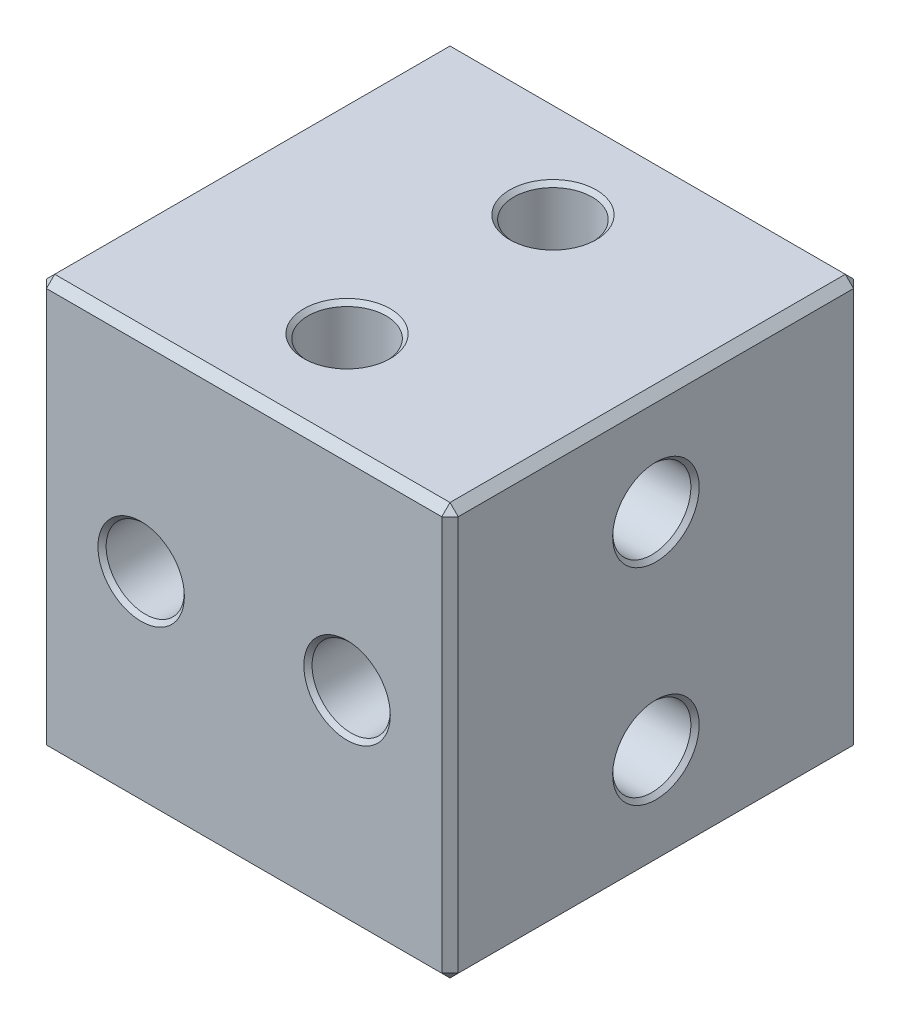
ISO-10303-21;
HEADER;
FILE_DESCRIPTION(('STEP AP214'),'2;1');
FILE_NAME('part.step','',(''),(''),'','','');
FILE_SCHEMA(('AUTOMOTIVE_DESIGN { 1 0 10303 214 1 1 1 1 }'));
ENDSEC;
DATA;
#1=APPLICATION_CONTEXT('core data for automotive mechanical design processes');
#2=APPLICATION_PROTOCOL_DEFINITION('international standard','automotive_design',2000,#1);
#3=PRODUCT_CONTEXT('',#1,'mechanical');
#4=PRODUCT('Part','Part','',(#3));
#5=PRODUCT_RELATED_PRODUCT_CATEGORY('part','',(#4));
#6=PRODUCT_DEFINITION_FORMATION('','',#4);
#7=PRODUCT_DEFINITION_CONTEXT('part definition',#1,'design');
#8=PRODUCT_DEFINITION('design','',#6,#7);
#9=PRODUCT_DEFINITION_SHAPE('','',#8);
#10=(LENGTH_UNIT() NAMED_UNIT(*) SI_UNIT(.MILLI.,.METRE.));
#11=(NAMED_UNIT(*) PLANE_ANGLE_UNIT() SI_UNIT($,.RADIAN.));
#12=(NAMED_UNIT(*) SI_UNIT($,.STERADIAN.) SOLID_ANGLE_UNIT());
#13=UNCERTAINTY_MEASURE_WITH_UNIT(LENGTH_MEASURE(1.E-05),#10,'distance_accuracy_value','');
#14=(GEOMETRIC_REPRESENTATION_CONTEXT(3) GLOBAL_UNCERTAINTY_ASSIGNED_CONTEXT((#13)) GLOBAL_UNIT_ASSIGNED_CONTEXT((#10,
#11,#12)) REPRESENTATION_CONTEXT('',''));
#15=CARTESIAN_POINT('',(0.,0.,0.));
#16=DIRECTION('',(0.,0.,1.));
#17=DIRECTION('',(1.,0.,0.));
#18=AXIS2_PLACEMENT_3D('',#15,#16,#17);
#19=CARTESIAN_POINT('',(-5.,5.,10.));
#20=DIRECTION('',(1.,0.,0.));
#21=DIRECTION('',(0.,1.,0.));
#22=AXIS2_PLACEMENT_3D('',#19,#20,#21);
#23=PLANE('',#22);
#24=CARTESIAN_POINT('',(-5.,-2.5,5.));
#25=DIRECTION('',(1.,0.,0.));
#26=DIRECTION('',(0.,1.,0.));
#27=AXIS2_PLACEMENT_3D('',#24,#25,#26);
#28=CIRCLE('',#27,1.05);
#29=CARTESIAN_POINT('',(-5.,-1.45,5.));
#30=VERTEX_POINT('',#29);
#31=EDGE_CURVE('E248',#30,#30,#28,.T.);
#32=ORIENTED_EDGE('',*,*,#31,.T.);
#33=EDGE_LOOP('',(#32));
#34=FACE_BOUND('',#33,.T.);
#35=CARTESIAN_POINT('',(-5.,2.5,5.));
#36=DIRECTION('',(1.,0.,0.));
#37=DIRECTION('',(0.,1.,0.));
#38=AXIS2_PLACEMENT_3D('',#35,#36,#37);
#39=CIRCLE('',#38,1.04999999999999);
#40=CARTESIAN_POINT('',(-5.,3.54999999999999,5.));
#41=VERTEX_POINT('',#40);
#42=EDGE_CURVE('E245',#41,#41,#39,.T.);
#43=ORIENTED_EDGE('',*,*,#42,.T.);
#44=EDGE_LOOP('',(#43));
#45=FACE_BOUND('',#44,.T.);
#46=DIRECTION('',(0.,-1.,0.));
#47=VECTOR('',#46,1.);
#48=CARTESIAN_POINT('',(-5.,5.,0.200000000000001));
#49=LINE('',#48,#47);
#50=CARTESIAN_POINT('',(-5.,4.8,0.200000000000001));
#51=VERTEX_POINT('',#50);
#52=CARTESIAN_POINT('',(-5.,-4.8,0.200000000000001));
#53=VERTEX_POINT('',#52);
#54=EDGE_CURVE('E503',#51,#53,#49,.T.);
#55=ORIENTED_EDGE('',*,*,#54,.T.);
#56=DIRECTION('',(0.,0.,1.));
#57=VECTOR('',#56,1.);
#58=CARTESIAN_POINT('',(-5.,-4.8,10.));
#59=LINE('',#58,#57);
#60=CARTESIAN_POINT('',(-5.,-4.8,9.8));
#61=VERTEX_POINT('',#60);
#62=EDGE_CURVE('E507',#53,#61,#59,.T.);
#63=ORIENTED_EDGE('',*,*,#62,.T.);
#64=DIRECTION('',(0.,1.,0.));
#65=VECTOR('',#64,1.);
#66=CARTESIAN_POINT('',(-5.,5.,9.8));
#67=LINE('',#66,#65);
#68=CARTESIAN_POINT('',(-5.,4.8,9.8));
#69=VERTEX_POINT('',#68);
#70=EDGE_CURVE('E505',#61,#69,#67,.T.);
#71=ORIENTED_EDGE('',*,*,#70,.T.);
#72=DIRECTION('',(0.,0.,-1.));
#73=VECTOR('',#72,1.);
#74=CARTESIAN_POINT('',(-5.,4.8,10.));
#75=LINE('',#74,#73);
#76=EDGE_CURVE('E484',#69,#51,#75,.T.);
#77=ORIENTED_EDGE('',*,*,#76,.T.);
#78=EDGE_LOOP('',(#55,#63,#71,#77));
#79=FACE_BOUND('',#78,.T.);
#80=ADVANCED_FACE('F35',(#34,#45,#79),#23,.F.);
#81=CARTESIAN_POINT('',(-5.,-5.,10.));
#82=DIRECTION('',(0.,1.,0.));
#83=DIRECTION('',(0.,0.,1.));
#84=AXIS2_PLACEMENT_3D('',#81,#82,#83);
#85=PLANE('',#84);
#86=CARTESIAN_POINT('',(0.,-5.,2.5));
#87=DIRECTION('',(0.,1.,0.));
#88=DIRECTION('',(0.,0.,1.));
#89=AXIS2_PLACEMENT_3D('',#86,#87,#88);
#90=CIRCLE('',#89,1.05);
#91=CARTESIAN_POINT('',(0.,-5.,3.55));
#92=VERTEX_POINT('',#91);
#93=EDGE_CURVE('E266',#92,#92,#90,.T.);
#94=ORIENTED_EDGE('',*,*,#93,.T.);
#95=EDGE_LOOP('',(#94));
#96=FACE_BOUND('',#95,.T.);
#97=CARTESIAN_POINT('',(0.,-5.,7.5));
#98=DIRECTION('',(0.,1.,0.));
#99=DIRECTION('',(0.,0.,1.));
#100=AXIS2_PLACEMENT_3D('',#97,#98,#99);
#101=CIRCLE('',#100,1.05);
#102=CARTESIAN_POINT('',(0.,-5.,8.55));
#103=VERTEX_POINT('',#102);
#104=EDGE_CURVE('E263',#103,#103,#101,.T.);
#105=ORIENTED_EDGE('',*,*,#104,.T.);
#106=EDGE_LOOP('',(#105));
#107=FACE_BOUND('',#106,.T.);
#108=DIRECTION('',(0.,0.,1.));
#109=VECTOR('',#108,1.);
#110=CARTESIAN_POINT('',(4.8,-5.,10.));
#111=LINE('',#110,#109);
#112=CARTESIAN_POINT('',(4.8,-5.,0.200000000000001));
#113=VERTEX_POINT('',#112);
#114=CARTESIAN_POINT('',(4.8,-5.,9.8));
#115=VERTEX_POINT('',#114);
#116=EDGE_CURVE('E464',#113,#115,#111,.T.);
#117=ORIENTED_EDGE('',*,*,#116,.T.);
#118=DIRECTION('',(-1.,0.,0.));
#119=VECTOR('',#118,1.);
#120=CARTESIAN_POINT('',(-5.,-5.,9.8));
#121=LINE('',#120,#119);
#122=CARTESIAN_POINT('',(-4.8,-5.,9.8));
#123=VERTEX_POINT('',#122);
#124=EDGE_CURVE('E467',#115,#123,#121,.T.);
#125=ORIENTED_EDGE('',*,*,#124,.T.);
#126=DIRECTION('',(0.,0.,-1.));
#127=VECTOR('',#126,1.);
#128=CARTESIAN_POINT('',(-4.8,-5.,10.));
#129=LINE('',#128,#127);
#130=CARTESIAN_POINT('',(-4.8,-5.,0.200000000000001));
#131=VERTEX_POINT('',#130);
#132=EDGE_CURVE('E471',#123,#131,#129,.T.);
#133=ORIENTED_EDGE('',*,*,#132,.T.);
#134=DIRECTION('',(1.,0.,0.));
#135=VECTOR('',#134,1.);
#136=CARTESIAN_POINT('',(-5.,-5.,0.200000000000001));
#137=LINE('',#136,#135);
#138=EDGE_CURVE('E469',#131,#113,#137,.T.);
#139=ORIENTED_EDGE('',*,*,#138,.T.);
#140=EDGE_LOOP('',(#117,#125,#133,#139));
#141=FACE_BOUND('',#140,.T.);
#142=ADVANCED_FACE('F296',(#96,#107,#141),#85,.F.);
#143=CARTESIAN_POINT('',(5.,5.,10.));
#144=DIRECTION('',(-1.,0.,0.));
#145=DIRECTION('',(0.,-1.,0.));
#146=AXIS2_PLACEMENT_3D('',#143,#144,#145);
#147=PLANE('',#146);
#148=CARTESIAN_POINT('',(5.,2.5,5.));
#149=DIRECTION('',(-1.,0.,0.));
#150=DIRECTION('',(0.,-1.,0.));
#151=AXIS2_PLACEMENT_3D('',#148,#149,#150);
#152=CIRCLE('',#151,1.05);
#153=CARTESIAN_POINT('',(5.,1.45,5.));
#154=VERTEX_POINT('',#153);
#155=EDGE_CURVE('E11',#154,#154,#152,.T.);
#156=ORIENTED_EDGE('',*,*,#155,.T.);
#157=EDGE_LOOP('',(#156));
#158=FACE_BOUND('',#157,.T.);
#159=CARTESIAN_POINT('',(5.,-2.5,5.));
#160=DIRECTION('',(-1.,0.,0.));
#161=DIRECTION('',(0.,-1.,0.));
#162=AXIS2_PLACEMENT_3D('',#159,#160,#161);
#163=CIRCLE('',#162,1.05);
#164=CARTESIAN_POINT('',(5.,-3.55,5.));
#165=VERTEX_POINT('',#164);
#166=EDGE_CURVE('E43',#165,#165,#163,.T.);
#167=ORIENTED_EDGE('',*,*,#166,.T.);
#168=EDGE_LOOP('',(#167));
#169=FACE_BOUND('',#168,.T.);
#170=DIRECTION('',(0.,0.,1.));
#171=VECTOR('',#170,1.);
#172=CARTESIAN_POINT('',(5.,4.8,10.));
#173=LINE('',#172,#171);
#174=CARTESIAN_POINT('',(5.,4.8,0.200000000000001));
#175=VERTEX_POINT('',#174);
#176=CARTESIAN_POINT('',(5.,4.8,9.8));
#177=VERTEX_POINT('',#176);
#178=EDGE_CURVE('E510',#175,#177,#173,.T.);
#179=ORIENTED_EDGE('',*,*,#178,.T.);
#180=DIRECTION('',(0.,-1.,0.));
#181=VECTOR('',#180,1.);
#182=CARTESIAN_POINT('',(5.,-5.,9.8));
#183=LINE('',#182,#181);
#184=CARTESIAN_POINT('',(5.,-4.8,9.8));
#185=VERTEX_POINT('',#184);
#186=EDGE_CURVE('E156',#177,#185,#183,.T.);
#187=ORIENTED_EDGE('',*,*,#186,.T.);
#188=DIRECTION('',(0.,0.,-1.));
#189=VECTOR('',#188,1.);
#190=CARTESIAN_POINT('',(5.,-4.8,10.));
#191=LINE('',#190,#189);
#192=CARTESIAN_POINT('',(5.,-4.8,0.200000000000001));
#193=VERTEX_POINT('',#192);
#194=EDGE_CURVE('E475',#185,#193,#191,.T.);
#195=ORIENTED_EDGE('',*,*,#194,.T.);
#196=DIRECTION('',(0.,1.,0.));
#197=VECTOR('',#196,1.);
#198=CARTESIAN_POINT('',(5.,5.,0.200000000000001));
#199=LINE('',#198,#197);
#200=EDGE_CURVE('E512',#193,#175,#199,.T.);
#201=ORIENTED_EDGE('',*,*,#200,.T.);
#202=EDGE_LOOP('',(#179,#187,#195,#201));
#203=FACE_BOUND('',#202,.T.);
#204=ADVANCED_FACE('F271',(#158,#169,#203),#147,.F.);
#205=CARTESIAN_POINT('',(-5.,5.,10.));
#206=DIRECTION('',(0.,-1.,0.));
#207=DIRECTION('',(0.,0.,-1.));
#208=AXIS2_PLACEMENT_3D('',#205,#206,#207);
#209=PLANE('',#208);
#210=CARTESIAN_POINT('',(0.,5.,2.5));
#211=DIRECTION('',(0.,-1.,0.));
#212=DIRECTION('',(0.,0.,-1.));
#213=AXIS2_PLACEMENT_3D('',#210,#211,#212);
#214=CIRCLE('',#213,1.05);
#215=CARTESIAN_POINT('',(0.,5.,1.45));
#216=VERTEX_POINT('',#215);
#217=EDGE_CURVE('E236',#216,#216,#214,.T.);
#218=ORIENTED_EDGE('',*,*,#217,.T.);
#219=EDGE_LOOP('',(#218));
#220=FACE_BOUND('',#219,.T.);
#221=CARTESIAN_POINT('',(0.,5.,7.5));
#222=DIRECTION('',(0.,-1.,0.));
#223=DIRECTION('',(0.,0.,-1.));
#224=AXIS2_PLACEMENT_3D('',#221,#222,#223);
#225=CIRCLE('',#224,1.05);
#226=CARTESIAN_POINT('',(0.,5.,6.45));
#227=VERTEX_POINT('',#226);
#228=EDGE_CURVE('E233',#227,#227,#225,.T.);
#229=ORIENTED_EDGE('',*,*,#228,.T.);
#230=EDGE_LOOP('',(#229));
#231=FACE_BOUND('',#230,.T.);
#232=DIRECTION('',(-1.,0.,0.));
#233=VECTOR('',#232,1.);
#234=CARTESIAN_POINT('',(-5.,5.,0.200000000000001));
#235=LINE('',#234,#233);
#236=CARTESIAN_POINT('',(4.8,5.,0.200000000000001));
#237=VERTEX_POINT('',#236);
#238=CARTESIAN_POINT('',(-4.8,5.,0.200000000000001));
#239=VERTEX_POINT('',#238);
#240=EDGE_CURVE('E525',#237,#239,#235,.T.);
#241=ORIENTED_EDGE('',*,*,#240,.T.);
#242=DIRECTION('',(0.,0.,1.));
#243=VECTOR('',#242,1.);
#244=CARTESIAN_POINT('',(-4.8,5.,10.));
#245=LINE('',#244,#243);
#246=CARTESIAN_POINT('',(-4.8,5.,9.8));
#247=VERTEX_POINT('',#246);
#248=EDGE_CURVE('E206',#239,#247,#245,.T.);
#249=ORIENTED_EDGE('',*,*,#248,.T.);
#250=DIRECTION('',(1.,0.,0.));
#251=VECTOR('',#250,1.);
#252=CARTESIAN_POINT('',(5.,5.,9.8));
#253=LINE('',#252,#251);
#254=CARTESIAN_POINT('',(4.8,5.,9.8));
#255=VERTEX_POINT('',#254);
#256=EDGE_CURVE('E58',#247,#255,#253,.T.);
#257=ORIENTED_EDGE('',*,*,#256,.T.);
#258=DIRECTION('',(0.,0.,-1.));
#259=VECTOR('',#258,1.);
#260=CARTESIAN_POINT('',(4.8,5.,10.));
#261=LINE('',#260,#259);
#262=EDGE_CURVE('E527',#255,#237,#261,.T.);
#263=ORIENTED_EDGE('',*,*,#262,.T.);
#264=EDGE_LOOP('',(#241,#249,#257,#263));
#265=FACE_BOUND('',#264,.T.);
#266=ADVANCED_FACE('F424',(#220,#231,#265),#209,.F.);
#267=CARTESIAN_POINT('',(-5.,-5.,10.));
#268=DIRECTION('',(0.,0.,1.));
#269=DIRECTION('',(1.,0.,0.));
#270=AXIS2_PLACEMENT_3D('',#267,#268,#269);
#271=PLANE('',#270);
#272=CARTESIAN_POINT('',(-2.5,0.,10.));
#273=DIRECTION('',(0.,0.,1.));
#274=DIRECTION('',(1.,0.,0.));
#275=AXIS2_PLACEMENT_3D('',#272,#273,#274);
#276=CIRCLE('',#275,1.05);
#277=CARTESIAN_POINT('',(-1.45,0.,10.));
#278=VERTEX_POINT('',#277);
#279=EDGE_CURVE('E224',#278,#278,#276,.F.);
#280=ORIENTED_EDGE('',*,*,#279,.T.);
#281=EDGE_LOOP('',(#280));
#282=FACE_BOUND('',#281,.T.);
#283=CARTESIAN_POINT('',(2.5,0.,10.));
#284=DIRECTION('',(0.,0.,1.));
#285=DIRECTION('',(1.,0.,0.));
#286=AXIS2_PLACEMENT_3D('',#283,#284,#285);
#287=CIRCLE('',#286,1.05);
#288=CARTESIAN_POINT('',(3.55,0.,10.));
#289=VERTEX_POINT('',#288);
#290=EDGE_CURVE('E221',#289,#289,#287,.F.);
#291=ORIENTED_EDGE('',*,*,#290,.T.);
#292=EDGE_LOOP('',(#291));
#293=FACE_BOUND('',#292,.T.);
#294=DIRECTION('',(0.,-1.,0.));
#295=VECTOR('',#294,1.);
#296=CARTESIAN_POINT('',(-4.8,-5.,10.));
#297=LINE('',#296,#295);
#298=CARTESIAN_POINT('',(-4.8,4.8,10.));
#299=VERTEX_POINT('',#298);
#300=CARTESIAN_POINT('',(-4.8,-4.8,10.));
#301=VERTEX_POINT('',#300);
#302=EDGE_CURVE('E136',#299,#301,#297,.T.);
#303=ORIENTED_EDGE('',*,*,#302,.T.);
#304=DIRECTION('',(1.,0.,0.));
#305=VECTOR('',#304,1.);
#306=CARTESIAN_POINT('',(5.,-4.8,10.));
#307=LINE('',#306,#305);
#308=CARTESIAN_POINT('',(4.8,-4.8,10.));
#309=VERTEX_POINT('',#308);
#310=EDGE_CURVE('E132',#301,#309,#307,.T.);
#311=ORIENTED_EDGE('',*,*,#310,.T.);
#312=DIRECTION('',(0.,1.,0.));
#313=VECTOR('',#312,1.);
#314=CARTESIAN_POINT('',(4.8,5.,10.));
#315=LINE('',#314,#313);
#316=CARTESIAN_POINT('',(4.8,4.8,10.));
#317=VERTEX_POINT('',#316);
#318=EDGE_CURVE('E127',#309,#317,#315,.T.);
#319=ORIENTED_EDGE('',*,*,#318,.T.);
#320=DIRECTION('',(-1.,0.,0.));
#321=VECTOR('',#320,1.);
#322=CARTESIAN_POINT('',(-5.,4.8,10.));
#323=LINE('',#322,#321);
#324=EDGE_CURVE('E130',#317,#299,#323,.T.);
#325=ORIENTED_EDGE('',*,*,#324,.T.);
#326=EDGE_LOOP('',(#303,#311,#319,#325));
#327=FACE_BOUND('',#326,.T.);
#328=ADVANCED_FACE('F129',(#282,#293,#327),#271,.T.);
#329=CARTESIAN_POINT('',(-5.,-5.,0.));
#330=DIRECTION('',(0.,0.,1.));
#331=DIRECTION('',(1.,0.,0.));
#332=AXIS2_PLACEMENT_3D('',#329,#330,#331);
#333=PLANE('',#332);
#334=CARTESIAN_POINT('',(-2.5,0.,0.));
#335=DIRECTION('',(0.,0.,1.));
#336=DIRECTION('',(1.,0.,0.));
#337=AXIS2_PLACEMENT_3D('',#334,#335,#336);
#338=CIRCLE('',#337,1.05);
#339=CARTESIAN_POINT('',(-1.45,0.,0.));
#340=VERTEX_POINT('',#339);
#341=EDGE_CURVE('E205',#340,#340,#338,.T.);
#342=ORIENTED_EDGE('',*,*,#341,.T.);
#343=EDGE_LOOP('',(#342));
#344=FACE_BOUND('',#343,.T.);
#345=CARTESIAN_POINT('',(2.5,0.,0.));
#346=DIRECTION('',(0.,0.,1.));
#347=DIRECTION('',(1.,0.,0.));
#348=AXIS2_PLACEMENT_3D('',#345,#346,#347);
#349=CIRCLE('',#348,1.05);
#350=CARTESIAN_POINT('',(3.55,0.,0.));
#351=VERTEX_POINT('',#350);
#352=EDGE_CURVE('E202',#351,#351,#349,.T.);
#353=ORIENTED_EDGE('',*,*,#352,.T.);
#354=EDGE_LOOP('',(#353));
#355=FACE_BOUND('',#354,.T.);
#356=DIRECTION('',(0.,-1.,0.));
#357=VECTOR('',#356,1.);
#358=CARTESIAN_POINT('',(4.8,-5.,0.));
#359=LINE('',#358,#357);
#360=CARTESIAN_POINT('',(4.8,4.8,0.));
#361=VERTEX_POINT('',#360);
#362=CARTESIAN_POINT('',(4.8,-4.8,0.));
#363=VERTEX_POINT('',#362);
#364=EDGE_CURVE('E520',#361,#363,#359,.T.);
#365=ORIENTED_EDGE('',*,*,#364,.T.);
#366=DIRECTION('',(-1.,0.,0.));
#367=VECTOR('',#366,1.);
#368=CARTESIAN_POINT('',(-5.,-4.8,0.));
#369=LINE('',#368,#367);
#370=CARTESIAN_POINT('',(-4.8,-4.8,0.));
#371=VERTEX_POINT('',#370);
#372=EDGE_CURVE('E522',#363,#371,#369,.T.);
#373=ORIENTED_EDGE('',*,*,#372,.T.);
#374=DIRECTION('',(0.,1.,0.));
#375=VECTOR('',#374,1.);
#376=CARTESIAN_POINT('',(-4.8,-5.,0.));
#377=LINE('',#376,#375);
#378=CARTESIAN_POINT('',(-4.8,4.8,0.));
#379=VERTEX_POINT('',#378);
#380=EDGE_CURVE('E518',#371,#379,#377,.T.);
#381=ORIENTED_EDGE('',*,*,#380,.T.);
#382=DIRECTION('',(1.,0.,0.));
#383=VECTOR('',#382,1.);
#384=CARTESIAN_POINT('',(-5.,4.8,0.));
#385=LINE('',#384,#383);
#386=EDGE_CURVE('E516',#379,#361,#385,.T.);
#387=ORIENTED_EDGE('',*,*,#386,.T.);
#388=EDGE_LOOP('',(#365,#373,#381,#387));
#389=FACE_BOUND('',#388,.T.);
#390=ADVANCED_FACE('F431',(#344,#355,#389),#333,.F.);
#391=CARTESIAN_POINT('',(-2.5,0.,0.));
#392=DIRECTION('',(0.,0.,1.));
#393=DIRECTION('',(1.,0.,0.));
#394=AXIS2_PLACEMENT_3D('',#391,#392,#393);
#395=CYLINDRICAL_SURFACE('',#394,0.95);
#396=CARTESIAN_POINT('',(-2.5,0.,0.100000000000001));
#397=DIRECTION('',(0.,0.,1.));
#398=DIRECTION('',(1.,0.,0.));
#399=AXIS2_PLACEMENT_3D('',#396,#397,#398);
#400=CIRCLE('',#399,0.95);
#401=CARTESIAN_POINT('',(-1.55,0.,0.100000000000001));
#402=VERTEX_POINT('',#401);
#403=EDGE_CURVE('E212',#402,#402,#400,.F.);
#404=ORIENTED_EDGE('',*,*,#403,.T.);
#405=EDGE_LOOP('',(#404));
#406=FACE_BOUND('',#405,.T.);
#407=CARTESIAN_POINT('',(-2.5,0.,9.9));
#408=DIRECTION('',(0.,0.,1.));
#409=DIRECTION('',(1.,0.,0.));
#410=AXIS2_PLACEMENT_3D('',#407,#408,#409);
#411=CIRCLE('',#410,0.95);
#412=CARTESIAN_POINT('',(-1.55,0.,9.9));
#413=VERTEX_POINT('',#412);
#414=EDGE_CURVE('E209',#413,#413,#411,.T.);
#415=ORIENTED_EDGE('',*,*,#414,.T.);
#416=EDGE_LOOP('',(#415));
#417=FACE_BOUND('',#416,.T.);
#418=ADVANCED_FACE('F434',(#406,#417),#395,.F.);
#419=CARTESIAN_POINT('',(2.5,0.,0.));
#420=DIRECTION('',(0.,0.,1.));
#421=DIRECTION('',(1.,0.,0.));
#422=AXIS2_PLACEMENT_3D('',#419,#420,#421);
#423=CYLINDRICAL_SURFACE('',#422,0.95);
#424=CARTESIAN_POINT('',(2.5,0.,0.100000000000001));
#425=DIRECTION('',(0.,0.,1.));
#426=DIRECTION('',(1.,0.,0.));
#427=AXIS2_PLACEMENT_3D('',#424,#425,#426);
#428=CIRCLE('',#427,0.95);
#429=CARTESIAN_POINT('',(3.45,0.,0.100000000000001));
#430=VERTEX_POINT('',#429);
#431=EDGE_CURVE('E218',#430,#430,#428,.F.);
#432=ORIENTED_EDGE('',*,*,#431,.T.);
#433=EDGE_LOOP('',(#432));
#434=FACE_BOUND('',#433,.T.);
#435=CARTESIAN_POINT('',(2.5,0.,9.9));
#436=DIRECTION('',(0.,0.,1.));
#437=DIRECTION('',(1.,0.,0.));
#438=AXIS2_PLACEMENT_3D('',#435,#436,#437);
#439=CIRCLE('',#438,0.95);
#440=CARTESIAN_POINT('',(3.45,0.,9.9));
#441=VERTEX_POINT('',#440);
#442=EDGE_CURVE('E215',#441,#441,#439,.T.);
#443=ORIENTED_EDGE('',*,*,#442,.T.);
#444=EDGE_LOOP('',(#443));
#445=FACE_BOUND('',#444,.T.);
#446=ADVANCED_FACE('F441',(#434,#445),#423,.F.);
#447=CARTESIAN_POINT('',(0.,-5.,7.5));
#448=DIRECTION('',(0.,1.,0.));
#449=DIRECTION('',(0.,0.,1.));
#450=AXIS2_PLACEMENT_3D('',#447,#448,#449);
#451=CYLINDRICAL_SURFACE('',#450,0.95);
#452=CARTESIAN_POINT('',(0.,4.9,7.5));
#453=DIRECTION('',(0.,-1.,0.));
#454=DIRECTION('',(0.,0.,-1.));
#455=AXIS2_PLACEMENT_3D('',#452,#453,#454);
#456=CIRCLE('',#455,0.95);
#457=CARTESIAN_POINT('',(0.,4.9,6.55));
#458=VERTEX_POINT('',#457);
#459=EDGE_CURVE('E242',#458,#458,#456,.F.);
#460=ORIENTED_EDGE('',*,*,#459,.T.);
#461=EDGE_LOOP('',(#460));
#462=FACE_BOUND('',#461,.T.);
#463=CARTESIAN_POINT('',(0.,-4.9,7.5));
#464=DIRECTION('',(0.,1.,0.));
#465=DIRECTION('',(0.,0.,1.));
#466=AXIS2_PLACEMENT_3D('',#463,#464,#465);
#467=CIRCLE('',#466,0.95);
#468=CARTESIAN_POINT('',(0.,-4.9,8.45));
#469=VERTEX_POINT('',#468);
#470=EDGE_CURVE('E239',#469,#469,#467,.F.);
#471=ORIENTED_EDGE('',*,*,#470,.T.);
#472=EDGE_LOOP('',(#471));
#473=FACE_BOUND('',#472,.T.);
#474=ADVANCED_FACE('F445',(#462,#473),#451,.F.);
#475=CARTESIAN_POINT('',(0.,-5.,2.5));
#476=DIRECTION('',(0.,1.,0.));
#477=DIRECTION('',(0.,0.,1.));
#478=AXIS2_PLACEMENT_3D('',#475,#476,#477);
#479=CYLINDRICAL_SURFACE('',#478,0.95);
#480=CARTESIAN_POINT('',(0.,4.9,2.5));
#481=DIRECTION('',(0.,-1.,0.));
#482=DIRECTION('',(0.,0.,-1.));
#483=AXIS2_PLACEMENT_3D('',#480,#481,#482);
#484=CIRCLE('',#483,0.95);
#485=CARTESIAN_POINT('',(0.,4.9,1.55));
#486=VERTEX_POINT('',#485);
#487=EDGE_CURVE('E230',#486,#486,#484,.F.);
#488=ORIENTED_EDGE('',*,*,#487,.T.);
#489=EDGE_LOOP('',(#488));
#490=FACE_BOUND('',#489,.T.);
#491=CARTESIAN_POINT('',(0.,-4.9,2.5));
#492=DIRECTION('',(0.,1.,0.));
#493=DIRECTION('',(0.,0.,1.));
#494=AXIS2_PLACEMENT_3D('',#491,#492,#493);
#495=CIRCLE('',#494,0.95);
#496=CARTESIAN_POINT('',(0.,-4.9,3.45));
#497=VERTEX_POINT('',#496);
#498=EDGE_CURVE('E227',#497,#497,#495,.F.);
#499=ORIENTED_EDGE('',*,*,#498,.T.);
#500=EDGE_LOOP('',(#499));
#501=FACE_BOUND('',#500,.T.);
#502=ADVANCED_FACE('F292',(#490,#501),#479,.F.);
#503=CARTESIAN_POINT('',(-5.,2.5,5.));
#504=DIRECTION('',(1.,0.,0.));
#505=DIRECTION('',(0.,1.,0.));
#506=AXIS2_PLACEMENT_3D('',#503,#504,#505);
#507=CYLINDRICAL_SURFACE('',#506,0.95);
#508=CARTESIAN_POINT('',(-4.90000000000001,2.5,5.));
#509=DIRECTION('',(1.,0.,0.));
#510=DIRECTION('',(0.,0.,-1.));
#511=AXIS2_PLACEMENT_3D('',#508,#509,#510);
#512=CIRCLE('',#511,0.95);
#513=CARTESIAN_POINT('',(-4.90000000000001,2.5,4.05));
#514=VERTEX_POINT('',#513);
#515=EDGE_CURVE('E260',#514,#514,#512,.F.);
#516=ORIENTED_EDGE('',*,*,#515,.T.);
#517=EDGE_LOOP('',(#516));
#518=FACE_BOUND('',#517,.T.);
#519=CARTESIAN_POINT('',(4.9,2.5,5.));
#520=DIRECTION('',(-1.,0.,0.));
#521=DIRECTION('',(0.,0.,1.));
#522=AXIS2_PLACEMENT_3D('',#519,#520,#521);
#523=CIRCLE('',#522,0.95);
#524=CARTESIAN_POINT('',(4.9,2.5,5.95));
#525=VERTEX_POINT('',#524);
#526=EDGE_CURVE('E257',#525,#525,#523,.F.);
#527=ORIENTED_EDGE('',*,*,#526,.T.);
#528=EDGE_LOOP('',(#527));
#529=FACE_BOUND('',#528,.T.);
#530=ADVANCED_FACE('F282',(#518,#529),#507,.F.);
#531=CARTESIAN_POINT('',(-5.,-2.5,5.));
#532=DIRECTION('',(1.,0.,0.));
#533=DIRECTION('',(0.,1.,0.));
#534=AXIS2_PLACEMENT_3D('',#531,#532,#533);
#535=CYLINDRICAL_SURFACE('',#534,0.95);
#536=CARTESIAN_POINT('',(-4.9,-2.5,5.));
#537=DIRECTION('',(1.,0.,0.));
#538=DIRECTION('',(0.,0.,-1.));
#539=AXIS2_PLACEMENT_3D('',#536,#537,#538);
#540=CIRCLE('',#539,0.95);
#541=CARTESIAN_POINT('',(-4.9,-2.5,4.05));
#542=VERTEX_POINT('',#541);
#543=EDGE_CURVE('E254',#542,#542,#540,.F.);
#544=ORIENTED_EDGE('',*,*,#543,.T.);
#545=EDGE_LOOP('',(#544));
#546=FACE_BOUND('',#545,.T.);
#547=CARTESIAN_POINT('',(4.9,-2.5,5.));
#548=DIRECTION('',(-1.,0.,0.));
#549=DIRECTION('',(0.,0.,1.));
#550=AXIS2_PLACEMENT_3D('',#547,#548,#549);
#551=CIRCLE('',#550,0.95);
#552=CARTESIAN_POINT('',(4.9,-2.5,5.95));
#553=VERTEX_POINT('',#552);
#554=EDGE_CURVE('E251',#553,#553,#551,.F.);
#555=ORIENTED_EDGE('',*,*,#554,.T.);
#556=EDGE_LOOP('',(#555));
#557=FACE_BOUND('',#556,.T.);
#558=ADVANCED_FACE('F279',(#546,#557),#535,.F.);
#559=CARTESIAN_POINT('',(-5.,5.,0.200000000000001));
#560=DIRECTION('',(0.,-0.707106781186551,0.707106781186544));
#561=DIRECTION('',(0.,-0.707106781186544,-0.707106781186551));
#562=AXIS2_PLACEMENT_3D('',#559,#560,#561);
#563=PLANE('',#562);
#564=DIRECTION('',(0.,0.707106781186544,0.70710678118655));
#565=VECTOR('',#564,1.);
#566=CARTESIAN_POINT('',(-4.8,4.8,0.));
#567=LINE('',#566,#565);
#568=EDGE_CURVE('E144',#239,#379,#567,.F.);
#569=ORIENTED_EDGE('',*,*,#568,.F.);
#570=ORIENTED_EDGE('',*,*,#240,.F.);
#571=DIRECTION('',(0.,-0.707106781186544,-0.70710678118655));
#572=VECTOR('',#571,1.);
#573=CARTESIAN_POINT('',(4.8,4.9,0.100000000000001));
#574=LINE('',#573,#572);
#575=EDGE_CURVE('E197',#361,#237,#574,.F.);
#576=ORIENTED_EDGE('',*,*,#575,.F.);
#577=ORIENTED_EDGE('',*,*,#386,.F.);
#578=EDGE_LOOP('',(#569,#570,#576,#577));
#579=FACE_BOUND('',#578,.T.);
#580=ADVANCED_FACE('F281',(#579),#563,.F.);
#581=CARTESIAN_POINT('',(-4.8,4.8,0.));
#582=DIRECTION('',(-0.577350269189625,0.57735026918963,-0.577350269189622));
#583=DIRECTION('',(-0.707106781186551,-0.707106781186545,0.));
#584=AXIS2_PLACEMENT_3D('',#581,#582,#583);
#585=PLANE('',#584);
#586=DIRECTION('',(-0.707106781186551,-0.707106781186544,0.));
#587=VECTOR('',#586,1.);
#588=CARTESIAN_POINT('',(-4.9,4.9,0.200000000000001));
#589=LINE('',#588,#587);
#590=EDGE_CURVE('E191',#239,#51,#589,.T.);
#591=ORIENTED_EDGE('',*,*,#590,.F.);
#592=ORIENTED_EDGE('',*,*,#568,.T.);
#593=DIRECTION('',(0.707106781186546,0.,-0.707106781186549));
#594=VECTOR('',#593,1.);
#595=CARTESIAN_POINT('',(-4.8,4.8,0.));
#596=LINE('',#595,#594);
#597=EDGE_CURVE('E194',#51,#379,#596,.T.);
#598=ORIENTED_EDGE('',*,*,#597,.F.);
#599=EDGE_LOOP('',(#591,#592,#598));
#600=FACE_BOUND('',#599,.T.);
#601=ADVANCED_FACE('F289',(#600),#585,.T.);
#602=CARTESIAN_POINT('',(5.,4.8,0.200000000000001));
#603=DIRECTION('',(0.577350269189625,0.57735026918963,-0.577350269189622));
#604=DIRECTION('',(-0.707106781186551,0.707106781186545,0.));
#605=AXIS2_PLACEMENT_3D('',#602,#603,#604);
#606=PLANE('',#605);
#607=DIRECTION('',(0.707106781186546,0.,0.707106781186549));
#608=VECTOR('',#607,1.);
#609=CARTESIAN_POINT('',(5.,4.8,0.200000000000001));
#610=LINE('',#609,#608);
#611=EDGE_CURVE('E185',#361,#175,#610,.T.);
#612=ORIENTED_EDGE('',*,*,#611,.F.);
#613=ORIENTED_EDGE('',*,*,#575,.T.);
#614=DIRECTION('',(-0.707106781186551,0.707106781186544,0.));
#615=VECTOR('',#614,1.);
#616=CARTESIAN_POINT('',(5.,4.8,0.200000000000001));
#617=LINE('',#616,#615);
#618=EDGE_CURVE('E188',#175,#237,#617,.T.);
#619=ORIENTED_EDGE('',*,*,#618,.F.);
#620=EDGE_LOOP('',(#612,#613,#619));
#621=FACE_BOUND('',#620,.T.);
#622=ADVANCED_FACE('F368',(#621),#606,.T.);
#623=CARTESIAN_POINT('',(-5.,5.,0.200000000000001));
#624=DIRECTION('',(0.707106781186549,0.,0.707106781186546));
#625=DIRECTION('',(0.707106781186546,0.,-0.707106781186549));
#626=AXIS2_PLACEMENT_3D('',#623,#624,#625);
#627=PLANE('',#626);
#628=ORIENTED_EDGE('',*,*,#597,.T.);
#629=ORIENTED_EDGE('',*,*,#380,.F.);
#630=DIRECTION('',(-0.707106781186546,0.,0.707106781186549));
#631=VECTOR('',#630,1.);
#632=CARTESIAN_POINT('',(-4.9,-4.8,0.1));
#633=LINE('',#632,#631);
#634=EDGE_CURVE('E180',#53,#371,#633,.F.);
#635=ORIENTED_EDGE('',*,*,#634,.F.);
#636=ORIENTED_EDGE('',*,*,#54,.F.);
#637=EDGE_LOOP('',(#628,#629,#635,#636));
#638=FACE_BOUND('',#637,.T.);
#639=ADVANCED_FACE('F364',(#638),#627,.F.);
#640=CARTESIAN_POINT('',(-5.,4.8,10.));
#641=DIRECTION('',(0.707106781186544,-0.707106781186551,0.));
#642=DIRECTION('',(0.707106781186551,0.707106781186544,0.));
#643=AXIS2_PLACEMENT_3D('',#640,#641,#642);
#644=PLANE('',#643);
#645=ORIENTED_EDGE('',*,*,#590,.T.);
#646=ORIENTED_EDGE('',*,*,#76,.F.);
#647=DIRECTION('',(0.707106781186551,0.707106781186545,0.));
#648=VECTOR('',#647,1.);
#649=CARTESIAN_POINT('',(-5.,4.8,9.8));
#650=LINE('',#649,#648);
#651=EDGE_CURVE('E178',#247,#69,#650,.F.);
#652=ORIENTED_EDGE('',*,*,#651,.F.);
#653=ORIENTED_EDGE('',*,*,#248,.F.);
#654=EDGE_LOOP('',(#645,#646,#652,#653));
#655=FACE_BOUND('',#654,.T.);
#656=ADVANCED_FACE('F361',(#655),#644,.F.);
#657=CARTESIAN_POINT('',(-5.,4.8,10.));
#658=DIRECTION('',(0.,0.707106781186551,0.707106781186544));
#659=DIRECTION('',(0.,-0.707106781186544,0.707106781186551));
#660=AXIS2_PLACEMENT_3D('',#657,#658,#659);
#661=PLANE('',#660);
#662=DIRECTION('',(0.,-0.707106781186544,0.707106781186551));
#663=VECTOR('',#662,1.);
#664=CARTESIAN_POINT('',(4.8,4.8,10.));
#665=LINE('',#664,#663);
#666=EDGE_CURVE('E142',#255,#317,#665,.T.);
#667=ORIENTED_EDGE('',*,*,#666,.F.);
#668=ORIENTED_EDGE('',*,*,#256,.F.);
#669=DIRECTION('',(0.,0.707106781186544,-0.707106781186551));
#670=VECTOR('',#669,1.);
#671=CARTESIAN_POINT('',(-4.8,4.9,9.9));
#672=LINE('',#671,#670);
#673=EDGE_CURVE('E50',#299,#247,#672,.T.);
#674=ORIENTED_EDGE('',*,*,#673,.F.);
#675=ORIENTED_EDGE('',*,*,#324,.F.);
#676=EDGE_LOOP('',(#667,#668,#674,#675));
#677=FACE_BOUND('',#676,.T.);
#678=ADVANCED_FACE('F141',(#677),#661,.T.);
#679=CARTESIAN_POINT('',(4.8,5.,10.));
#680=DIRECTION('',(-0.707106781186544,-0.707106781186551,0.));
#681=DIRECTION('',(0.707106781186551,-0.707106781186544,0.));
#682=AXIS2_PLACEMENT_3D('',#679,#680,#681);
#683=PLANE('',#682);
#684=ORIENTED_EDGE('',*,*,#618,.T.);
#685=ORIENTED_EDGE('',*,*,#262,.F.);
#686=DIRECTION('',(0.707106781186551,-0.707106781186544,0.));
#687=VECTOR('',#686,1.);
#688=CARTESIAN_POINT('',(4.9,4.9,9.8));
#689=LINE('',#688,#687);
#690=EDGE_CURVE('E152',#177,#255,#689,.F.);
#691=ORIENTED_EDGE('',*,*,#690,.F.);
#692=ORIENTED_EDGE('',*,*,#178,.F.);
#693=EDGE_LOOP('',(#684,#685,#691,#692));
#694=FACE_BOUND('',#693,.T.);
#695=ADVANCED_FACE('F354',(#694),#683,.F.);
#696=CARTESIAN_POINT('',(5.,5.,0.200000000000001));
#697=DIRECTION('',(-0.707106781186549,0.,0.707106781186546));
#698=DIRECTION('',(0.707106781186546,0.,0.707106781186549));
#699=AXIS2_PLACEMENT_3D('',#696,#697,#698);
#700=PLANE('',#699);
#701=ORIENTED_EDGE('',*,*,#611,.T.);
#702=ORIENTED_EDGE('',*,*,#200,.F.);
#703=DIRECTION('',(-0.707106781186546,0.,-0.707106781186549));
#704=VECTOR('',#703,1.);
#705=CARTESIAN_POINT('',(5.,-4.8,0.200000000000001));
#706=LINE('',#705,#704);
#707=EDGE_CURVE('E173',#363,#193,#706,.F.);
#708=ORIENTED_EDGE('',*,*,#707,.F.);
#709=ORIENTED_EDGE('',*,*,#364,.F.);
#710=EDGE_LOOP('',(#701,#702,#708,#709));
#711=FACE_BOUND('',#710,.T.);
#712=ADVANCED_FACE('F350',(#711),#700,.F.);
#713=CARTESIAN_POINT('',(-5.,-5.,0.200000000000001));
#714=DIRECTION('',(0.,0.707106781186551,0.707106781186544));
#715=DIRECTION('',(0.,-0.707106781186544,0.707106781186551));
#716=AXIS2_PLACEMENT_3D('',#713,#714,#715);
#717=PLANE('',#716);
#718=DIRECTION('',(0.,0.707106781186544,-0.70710678118655));
#719=VECTOR('',#718,1.);
#720=CARTESIAN_POINT('',(-4.8,-5.,0.200000000000001));
#721=LINE('',#720,#719);
#722=EDGE_CURVE('E182',#371,#131,#721,.F.);
#723=ORIENTED_EDGE('',*,*,#722,.F.);
#724=ORIENTED_EDGE('',*,*,#372,.F.);
#725=DIRECTION('',(0.,-0.707106781186544,0.707106781186551));
#726=VECTOR('',#725,1.);
#727=CARTESIAN_POINT('',(4.8,-4.9,0.1));
#728=LINE('',#727,#726);
#729=EDGE_CURVE('E170',#113,#363,#728,.F.);
#730=ORIENTED_EDGE('',*,*,#729,.F.);
#731=ORIENTED_EDGE('',*,*,#138,.F.);
#732=EDGE_LOOP('',(#723,#724,#730,#731));
#733=FACE_BOUND('',#732,.T.);
#734=ADVANCED_FACE('F346',(#733),#717,.F.);
#735=CARTESIAN_POINT('',(-4.8,-5.,0.200000000000001));
#736=DIRECTION('',(-0.577350269189625,-0.57735026918963,-0.577350269189622));
#737=DIRECTION('',(0.707106781186551,-0.707106781186545,0.));
#738=AXIS2_PLACEMENT_3D('',#735,#736,#737);
#739=PLANE('',#738);
#740=ORIENTED_EDGE('',*,*,#634,.T.);
#741=ORIENTED_EDGE('',*,*,#722,.T.);
#742=DIRECTION('',(0.707106781186551,-0.707106781186544,0.));
#743=VECTOR('',#742,1.);
#744=CARTESIAN_POINT('',(-4.8,-5.,0.200000000000001));
#745=LINE('',#744,#743);
#746=EDGE_CURVE('E161',#53,#131,#745,.T.);
#747=ORIENTED_EDGE('',*,*,#746,.F.);
#748=EDGE_LOOP('',(#740,#741,#747));
#749=FACE_BOUND('',#748,.T.);
#750=ADVANCED_FACE('F343',(#749),#739,.T.);
#751=CARTESIAN_POINT('',(-5.,4.8,9.8));
#752=DIRECTION('',(-0.57735026918962,0.57735026918963,0.577350269189627));
#753=DIRECTION('',(0.,-0.707106781186546,0.707106781186549));
#754=AXIS2_PLACEMENT_3D('',#751,#752,#753);
#755=PLANE('',#754);
#756=ORIENTED_EDGE('',*,*,#673,.T.);
#757=ORIENTED_EDGE('',*,*,#651,.T.);
#758=DIRECTION('',(0.707106781186552,0.,0.707106781186543));
#759=VECTOR('',#758,1.);
#760=CARTESIAN_POINT('',(-5.,4.8,9.8));
#761=LINE('',#760,#759);
#762=EDGE_CURVE('E157',#299,#69,#761,.F.);
#763=ORIENTED_EDGE('',*,*,#762,.F.);
#764=EDGE_LOOP('',(#756,#757,#763));
#765=FACE_BOUND('',#764,.T.);
#766=ADVANCED_FACE('F340',(#765),#755,.T.);
#767=CARTESIAN_POINT('',(4.8,4.8,10.));
#768=DIRECTION('',(0.577350269189622,0.577350269189632,0.577350269189624));
#769=DIRECTION('',(0.,-0.707106781186543,0.707106781186552));
#770=AXIS2_PLACEMENT_3D('',#767,#768,#769);
#771=PLANE('',#770);
#772=ORIENTED_EDGE('',*,*,#690,.T.);
#773=ORIENTED_EDGE('',*,*,#666,.T.);
#774=DIRECTION('',(0.707106781186549,0.,-0.707106781186546));
#775=VECTOR('',#774,1.);
#776=CARTESIAN_POINT('',(4.8,4.8,10.));
#777=LINE('',#776,#775);
#778=EDGE_CURVE('E149',#177,#317,#777,.F.);
#779=ORIENTED_EDGE('',*,*,#778,.F.);
#780=EDGE_LOOP('',(#772,#773,#779));
#781=FACE_BOUND('',#780,.T.);
#782=ADVANCED_FACE('F148',(#781),#771,.T.);
#783=CARTESIAN_POINT('',(5.,-4.8,0.200000000000001));
#784=DIRECTION('',(0.577350269189629,-0.577350269189627,-0.577350269189622));
#785=DIRECTION('',(0.707106781186546,0.707106781186549,0.));
#786=AXIS2_PLACEMENT_3D('',#783,#784,#785);
#787=PLANE('',#786);
#788=ORIENTED_EDGE('',*,*,#729,.T.);
#789=ORIENTED_EDGE('',*,*,#707,.T.);
#790=DIRECTION('',(0.707106781186546,0.707106781186549,0.));
#791=VECTOR('',#790,1.);
#792=CARTESIAN_POINT('',(5.,-4.8,0.200000000000001));
#793=LINE('',#792,#791);
#794=EDGE_CURVE('E158',#113,#193,#793,.T.);
#795=ORIENTED_EDGE('',*,*,#794,.F.);
#796=EDGE_LOOP('',(#788,#789,#795));
#797=FACE_BOUND('',#796,.T.);
#798=ADVANCED_FACE('F333',(#797),#787,.T.);
#799=CARTESIAN_POINT('',(-4.8,-5.,10.));
#800=DIRECTION('',(0.707106781186544,0.707106781186551,0.));
#801=DIRECTION('',(-0.707106781186551,0.707106781186544,0.));
#802=AXIS2_PLACEMENT_3D('',#799,#800,#801);
#803=PLANE('',#802);
#804=ORIENTED_EDGE('',*,*,#746,.T.);
#805=ORIENTED_EDGE('',*,*,#132,.F.);
#806=DIRECTION('',(-0.707106781186551,0.707106781186544,0.));
#807=VECTOR('',#806,1.);
#808=CARTESIAN_POINT('',(-4.8,-5.,9.8));
#809=LINE('',#808,#807);
#810=EDGE_CURVE('E164',#61,#123,#809,.F.);
#811=ORIENTED_EDGE('',*,*,#810,.F.);
#812=ORIENTED_EDGE('',*,*,#62,.F.);
#813=EDGE_LOOP('',(#804,#805,#811,#812));
#814=FACE_BOUND('',#813,.T.);
#815=ADVANCED_FACE('F329',(#814),#803,.F.);
#816=CARTESIAN_POINT('',(-4.8,-5.,10.));
#817=DIRECTION('',(-0.707106781186543,0.,0.707106781186552));
#818=DIRECTION('',(0.707106781186552,0.,0.707106781186543));
#819=AXIS2_PLACEMENT_3D('',#816,#817,#818);
#820=PLANE('',#819);
#821=ORIENTED_EDGE('',*,*,#762,.T.);
#822=ORIENTED_EDGE('',*,*,#70,.F.);
#823=DIRECTION('',(-0.707106781186552,0.,-0.707106781186543));
#824=VECTOR('',#823,1.);
#825=CARTESIAN_POINT('',(-4.9,-4.8,9.9));
#826=LINE('',#825,#824);
#827=EDGE_CURVE('E492',#301,#61,#826,.T.);
#828=ORIENTED_EDGE('',*,*,#827,.F.);
#829=ORIENTED_EDGE('',*,*,#302,.F.);
#830=EDGE_LOOP('',(#821,#822,#828,#829));
#831=FACE_BOUND('',#830,.T.);
#832=ADVANCED_FACE('F326',(#831),#820,.T.);
#833=CARTESIAN_POINT('',(4.8,-5.,10.));
#834=DIRECTION('',(0.707106781186546,0.,0.707106781186549));
#835=DIRECTION('',(0.707106781186549,0.,-0.707106781186546));
#836=AXIS2_PLACEMENT_3D('',#833,#834,#835);
#837=PLANE('',#836);
#838=ORIENTED_EDGE('',*,*,#778,.T.);
#839=ORIENTED_EDGE('',*,*,#318,.F.);
#840=DIRECTION('',(-0.707106781186549,0.,0.707106781186546));
#841=VECTOR('',#840,1.);
#842=CARTESIAN_POINT('',(4.8,-4.8,10.));
#843=LINE('',#842,#841);
#844=EDGE_CURVE('E478',#185,#309,#843,.T.);
#845=ORIENTED_EDGE('',*,*,#844,.F.);
#846=ORIENTED_EDGE('',*,*,#186,.F.);
#847=EDGE_LOOP('',(#838,#839,#845,#846));
#848=FACE_BOUND('',#847,.T.);
#849=ADVANCED_FACE('F154',(#848),#837,.T.);
#850=CARTESIAN_POINT('',(5.,-4.8,10.));
#851=DIRECTION('',(-0.707106781186549,0.707106781186546,0.));
#852=DIRECTION('',(-0.707106781186546,-0.707106781186549,0.));
#853=AXIS2_PLACEMENT_3D('',#850,#851,#852);
#854=PLANE('',#853);
#855=ORIENTED_EDGE('',*,*,#794,.T.);
#856=ORIENTED_EDGE('',*,*,#194,.F.);
#857=DIRECTION('',(-0.707106781186546,-0.707106781186549,0.));
#858=VECTOR('',#857,1.);
#859=CARTESIAN_POINT('',(4.9,-4.9,9.8));
#860=LINE('',#859,#858);
#861=EDGE_CURVE('E474',#115,#185,#860,.F.);
#862=ORIENTED_EDGE('',*,*,#861,.F.);
#863=ORIENTED_EDGE('',*,*,#116,.F.);
#864=EDGE_LOOP('',(#855,#856,#862,#863));
#865=FACE_BOUND('',#864,.T.);
#866=ADVANCED_FACE('F319',(#865),#854,.F.);
#867=CARTESIAN_POINT('',(-4.8,-5.,9.8));
#868=DIRECTION('',(-0.57735026918962,-0.577350269189625,0.577350269189633));
#869=DIRECTION('',(0.,-0.707106781186552,-0.707106781186543));
#870=AXIS2_PLACEMENT_3D('',#867,#868,#869);
#871=PLANE('',#870);
#872=ORIENTED_EDGE('',*,*,#827,.T.);
#873=ORIENTED_EDGE('',*,*,#810,.T.);
#874=DIRECTION('',(0.,0.707106781186551,0.707106781186544));
#875=VECTOR('',#874,1.);
#876=CARTESIAN_POINT('',(-4.8,-5.,9.8));
#877=LINE('',#876,#875);
#878=EDGE_CURVE('E479',#301,#123,#877,.F.);
#879=ORIENTED_EDGE('',*,*,#878,.F.);
#880=EDGE_LOOP('',(#872,#873,#879));
#881=FACE_BOUND('',#880,.T.);
#882=ADVANCED_FACE('F315',(#881),#871,.T.);
#883=CARTESIAN_POINT('',(4.8,-4.8,10.));
#884=DIRECTION('',(0.577350269189626,-0.577350269189623,0.577350269189628));
#885=DIRECTION('',(0.707106781186549,0.,-0.707106781186546));
#886=AXIS2_PLACEMENT_3D('',#883,#884,#885);
#887=PLANE('',#886);
#888=ORIENTED_EDGE('',*,*,#861,.T.);
#889=ORIENTED_EDGE('',*,*,#844,.T.);
#890=DIRECTION('',(0.,-0.707106781186551,-0.707106781186544));
#891=VECTOR('',#890,1.);
#892=CARTESIAN_POINT('',(4.8,-4.8,10.));
#893=LINE('',#892,#891);
#894=EDGE_CURVE('E481',#115,#309,#893,.F.);
#895=ORIENTED_EDGE('',*,*,#894,.F.);
#896=EDGE_LOOP('',(#888,#889,#895));
#897=FACE_BOUND('',#896,.T.);
#898=ADVANCED_FACE('F311',(#897),#887,.T.);
#899=CARTESIAN_POINT('',(-5.,-4.8,10.));
#900=DIRECTION('',(0.,-0.707106781186544,0.707106781186551));
#901=DIRECTION('',(0.,-0.707106781186551,-0.707106781186544));
#902=AXIS2_PLACEMENT_3D('',#899,#900,#901);
#903=PLANE('',#902);
#904=ORIENTED_EDGE('',*,*,#878,.T.);
#905=ORIENTED_EDGE('',*,*,#124,.F.);
#906=ORIENTED_EDGE('',*,*,#894,.T.);
#907=ORIENTED_EDGE('',*,*,#310,.F.);
#908=EDGE_LOOP('',(#904,#905,#906,#907));
#909=FACE_BOUND('',#908,.T.);
#910=ADVANCED_FACE('F307',(#909),#903,.T.);
#911=CARTESIAN_POINT('',(-2.5,0.,0.));
#912=DIRECTION('',(0.,0.,-1.));
#913=DIRECTION('',(-1.,0.,0.));
#914=AXIS2_PLACEMENT_3D('',#911,#912,#913);
#915=CONICAL_SURFACE('',#914,1.05,0.785398163397444);
#916=ORIENTED_EDGE('',*,*,#403,.F.);
#917=EDGE_LOOP('',(#916));
#918=FACE_BOUND('',#917,.T.);
#919=ORIENTED_EDGE('',*,*,#341,.F.);
#920=EDGE_LOOP('',(#919));
#921=FACE_BOUND('',#920,.T.);
#922=ADVANCED_FACE('F310',(#918,#921),#915,.F.);
#923=CARTESIAN_POINT('',(2.5,0.,0.));
#924=DIRECTION('',(0.,0.,-1.));
#925=DIRECTION('',(-1.,0.,0.));
#926=AXIS2_PLACEMENT_3D('',#923,#924,#925);
#927=CONICAL_SURFACE('',#926,1.05,0.785398163397444);
#928=ORIENTED_EDGE('',*,*,#431,.F.);
#929=EDGE_LOOP('',(#928));
#930=FACE_BOUND('',#929,.T.);
#931=ORIENTED_EDGE('',*,*,#352,.F.);
#932=EDGE_LOOP('',(#931));
#933=FACE_BOUND('',#932,.T.);
#934=ADVANCED_FACE('F378',(#930,#933),#927,.F.);
#935=CARTESIAN_POINT('',(-2.5,0.,9.9));
#936=DIRECTION('',(0.,0.,1.));
#937=DIRECTION('',(1.,0.,0.));
#938=AXIS2_PLACEMENT_3D('',#935,#936,#937);
#939=CONICAL_SURFACE('',#938,0.95,0.785398163397446);
#940=ORIENTED_EDGE('',*,*,#279,.F.);
#941=EDGE_LOOP('',(#940));
#942=FACE_BOUND('',#941,.T.);
#943=ORIENTED_EDGE('',*,*,#414,.F.);
#944=EDGE_LOOP('',(#943));
#945=FACE_BOUND('',#944,.T.);
#946=ADVANCED_FACE('F382',(#942,#945),#939,.F.);
#947=CARTESIAN_POINT('',(2.5,0.,9.9));
#948=DIRECTION('',(0.,0.,1.));
#949=DIRECTION('',(1.,0.,0.));
#950=AXIS2_PLACEMENT_3D('',#947,#948,#949);
#951=CONICAL_SURFACE('',#950,0.95,0.785398163397446);
#952=ORIENTED_EDGE('',*,*,#290,.F.);
#953=EDGE_LOOP('',(#952));
#954=FACE_BOUND('',#953,.T.);
#955=ORIENTED_EDGE('',*,*,#442,.F.);
#956=EDGE_LOOP('',(#955));
#957=FACE_BOUND('',#956,.T.);
#958=ADVANCED_FACE('F386',(#954,#957),#951,.F.);
#959=CARTESIAN_POINT('',(0.,4.9,2.5));
#960=DIRECTION('',(0.,1.,0.));
#961=DIRECTION('',(0.,0.,1.));
#962=AXIS2_PLACEMENT_3D('',#959,#960,#961);
#963=CONICAL_SURFACE('',#962,0.95,0.785398163397445);
#964=ORIENTED_EDGE('',*,*,#217,.F.);
#965=EDGE_LOOP('',(#964));
#966=FACE_BOUND('',#965,.T.);
#967=ORIENTED_EDGE('',*,*,#487,.F.);
#968=EDGE_LOOP('',(#967));
#969=FACE_BOUND('',#968,.T.);
#970=ADVANCED_FACE('F390',(#966,#969),#963,.F.);
#971=CARTESIAN_POINT('',(0.,4.9,7.5));
#972=DIRECTION('',(0.,1.,0.));
#973=DIRECTION('',(0.,0.,1.));
#974=AXIS2_PLACEMENT_3D('',#971,#972,#973);
#975=CONICAL_SURFACE('',#974,0.95,0.785398163397445);
#976=ORIENTED_EDGE('',*,*,#228,.F.);
#977=EDGE_LOOP('',(#976));
#978=FACE_BOUND('',#977,.T.);
#979=ORIENTED_EDGE('',*,*,#459,.F.);
#980=EDGE_LOOP('',(#979));
#981=FACE_BOUND('',#980,.T.);
#982=ADVANCED_FACE('F394',(#978,#981),#975,.F.);
#983=CARTESIAN_POINT('',(-5.,-2.5,5.));
#984=DIRECTION('',(-1.,0.,0.));
#985=DIRECTION('',(0.,0.,1.));
#986=AXIS2_PLACEMENT_3D('',#983,#984,#985);
#987=CONICAL_SURFACE('',#986,1.05,0.785398163397446);
#988=ORIENTED_EDGE('',*,*,#543,.F.);
#989=EDGE_LOOP('',(#988));
#990=FACE_BOUND('',#989,.T.);
#991=ORIENTED_EDGE('',*,*,#31,.F.);
#992=EDGE_LOOP('',(#991));
#993=FACE_BOUND('',#992,.T.);
#994=ADVANCED_FACE('F398',(#990,#993),#987,.F.);
#995=CARTESIAN_POINT('',(-5.,2.5,5.));
#996=DIRECTION('',(-1.,0.,0.));
#997=DIRECTION('',(0.,0.,1.));
#998=AXIS2_PLACEMENT_3D('',#995,#996,#997);
#999=CONICAL_SURFACE('',#998,1.04999999999999,0.785398163397438);
#1000=ORIENTED_EDGE('',*,*,#515,.F.);
#1001=EDGE_LOOP('',(#1000));
#1002=FACE_BOUND('',#1001,.T.);
#1003=ORIENTED_EDGE('',*,*,#42,.F.);
#1004=EDGE_LOOP('',(#1003));
#1005=FACE_BOUND('',#1004,.T.);
#1006=ADVANCED_FACE('F402',(#1002,#1005),#999,.F.);
#1007=CARTESIAN_POINT('',(0.,-5.,2.5));
#1008=DIRECTION('',(0.,-1.,0.));
#1009=DIRECTION('',(0.,0.,-1.));
#1010=AXIS2_PLACEMENT_3D('',#1007,#1008,#1009);
#1011=CONICAL_SURFACE('',#1010,1.05,0.785398163397445);
#1012=ORIENTED_EDGE('',*,*,#498,.F.);
#1013=EDGE_LOOP('',(#1012));
#1014=FACE_BOUND('',#1013,.T.);
#1015=ORIENTED_EDGE('',*,*,#93,.F.);
#1016=EDGE_LOOP('',(#1015));
#1017=FACE_BOUND('',#1016,.T.);
#1018=ADVANCED_FACE('F406',(#1014,#1017),#1011,.F.);
#1019=CARTESIAN_POINT('',(0.,-5.,7.5));
#1020=DIRECTION('',(0.,-1.,0.));
#1021=DIRECTION('',(0.,0.,-1.));
#1022=AXIS2_PLACEMENT_3D('',#1019,#1020,#1021);
#1023=CONICAL_SURFACE('',#1022,1.05,0.785398163397436);
#1024=ORIENTED_EDGE('',*,*,#470,.F.);
#1025=EDGE_LOOP('',(#1024));
#1026=FACE_BOUND('',#1025,.T.);
#1027=ORIENTED_EDGE('',*,*,#104,.F.);
#1028=EDGE_LOOP('',(#1027));
#1029=FACE_BOUND('',#1028,.T.);
#1030=ADVANCED_FACE('F410',(#1026,#1029),#1023,.F.);
#1031=CARTESIAN_POINT('',(4.9,2.5,5.));
#1032=DIRECTION('',(1.,0.,0.));
#1033=DIRECTION('',(0.,0.,-1.));
#1034=AXIS2_PLACEMENT_3D('',#1031,#1032,#1033);
#1035=CONICAL_SURFACE('',#1034,0.95,0.785398163397444);
#1036=ORIENTED_EDGE('',*,*,#155,.F.);
#1037=EDGE_LOOP('',(#1036));
#1038=FACE_BOUND('',#1037,.T.);
#1039=ORIENTED_EDGE('',*,*,#526,.F.);
#1040=EDGE_LOOP('',(#1039));
#1041=FACE_BOUND('',#1040,.T.);
#1042=ADVANCED_FACE('F276',(#1038,#1041),#1035,.F.);
#1043=CARTESIAN_POINT('',(4.9,-2.5,5.));
#1044=DIRECTION('',(1.,0.,0.));
#1045=DIRECTION('',(0.,0.,-1.));
#1046=AXIS2_PLACEMENT_3D('',#1043,#1044,#1045);
#1047=CONICAL_SURFACE('',#1046,0.95,0.785398163397444);
#1048=ORIENTED_EDGE('',*,*,#166,.F.);
#1049=EDGE_LOOP('',(#1048));
#1050=FACE_BOUND('',#1049,.T.);
#1051=ORIENTED_EDGE('',*,*,#554,.F.);
#1052=EDGE_LOOP('',(#1051));
#1053=FACE_BOUND('',#1052,.T.);
#1054=ADVANCED_FACE('F37',(#1050,#1053),#1047,.F.);
#1055=CLOSED_SHELL('',(#80,#142,#204,#266,#328,#390,#418,#446,#474,#502,#530,#558,#580,#601,
#622,#639,#656,#678,#695,#712,#734,#750,#766,#782,#798,#815,#832,#849,#866,#882,#898,#910,#922,
#934,#946,#958,#970,#982,#994,#1006,#1018,#1030,#1042,#1054));
#1056=MANIFOLD_SOLID_BREP('B2',#1055);
#1057=ADVANCED_BREP_SHAPE_REPRESENTATION('',(#18,#1056),#14);
#1058=SHAPE_DEFINITION_REPRESENTATION(#9,#1057);
ENDSEC;
END-ISO-10303-21;
